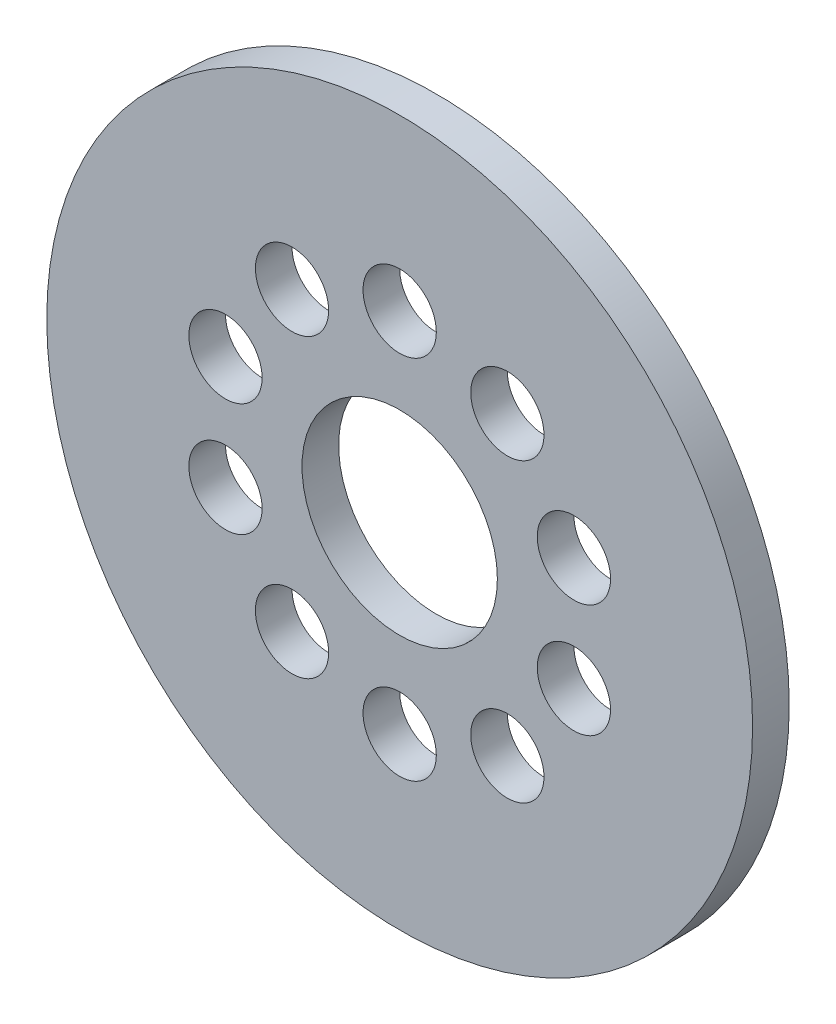
ISO-10303-21;
HEADER;
FILE_DESCRIPTION(('STEP AP214'),'2;1');
FILE_NAME('part.step','',(''),(''),'','','');
FILE_SCHEMA(('AUTOMOTIVE_DESIGN { 1 0 10303 214 1 1 1 1 }'));
ENDSEC;
DATA;
#1=APPLICATION_CONTEXT('core data for automotive mechanical design processes');
#2=APPLICATION_PROTOCOL_DEFINITION('international standard','automotive_design',2000,#1);
#3=PRODUCT_CONTEXT('',#1,'mechanical');
#4=PRODUCT('Part','Part','',(#3));
#5=PRODUCT_RELATED_PRODUCT_CATEGORY('part','',(#4));
#6=PRODUCT_DEFINITION_FORMATION('','',#4);
#7=PRODUCT_DEFINITION_CONTEXT('part definition',#1,'design');
#8=PRODUCT_DEFINITION('design','',#6,#7);
#9=PRODUCT_DEFINITION_SHAPE('','',#8);
#10=(LENGTH_UNIT() NAMED_UNIT(*) SI_UNIT(.MILLI.,.METRE.));
#11=(NAMED_UNIT(*) PLANE_ANGLE_UNIT() SI_UNIT($,.RADIAN.));
#12=(NAMED_UNIT(*) SI_UNIT($,.STERADIAN.) SOLID_ANGLE_UNIT());
#13=UNCERTAINTY_MEASURE_WITH_UNIT(LENGTH_MEASURE(1.E-05),#10,'distance_accuracy_value','');
#14=(GEOMETRIC_REPRESENTATION_CONTEXT(3) GLOBAL_UNCERTAINTY_ASSIGNED_CONTEXT((#13)) GLOBAL_UNIT_ASSIGNED_CONTEXT((#10,
#11,#12)) REPRESENTATION_CONTEXT('',''));
#15=CARTESIAN_POINT('',(0.,0.,0.));
#16=DIRECTION('',(0.,0.,1.));
#17=DIRECTION('',(1.,0.,0.));
#18=AXIS2_PLACEMENT_3D('',#15,#16,#17);
#19=CARTESIAN_POINT('',(0.,0.,7.5));
#20=DIRECTION('',(0.,0.,-1.));
#21=DIRECTION('',(-1.,0.,0.));
#22=AXIS2_PLACEMENT_3D('',#19,#20,#21);
#23=CYLINDRICAL_SURFACE('',#22,144.505);
#24=CARTESIAN_POINT('',(0.,0.,7.5));
#25=DIRECTION('',(0.,0.,1.));
#26=DIRECTION('',(1.,0.,0.));
#27=AXIS2_PLACEMENT_3D('',#24,#25,#26);
#28=CIRCLE('',#27,144.505);
#29=CARTESIAN_POINT('',(144.505,0.,7.5));
#30=VERTEX_POINT('',#29);
#31=EDGE_CURVE('E10',#30,#30,#28,.T.);
#32=ORIENTED_EDGE('',*,*,#31,.F.);
#33=EDGE_LOOP('',(#32));
#34=FACE_BOUND('',#33,.T.);
#35=CARTESIAN_POINT('',(0.,0.,-7.5));
#36=DIRECTION('',(0.,0.,1.));
#37=DIRECTION('',(1.,0.,0.));
#38=AXIS2_PLACEMENT_3D('',#35,#36,#37);
#39=CIRCLE('',#38,144.505);
#40=CARTESIAN_POINT('',(144.505,0.,-7.5));
#41=VERTEX_POINT('',#40);
#42=EDGE_CURVE('E40',#41,#41,#39,.T.);
#43=ORIENTED_EDGE('',*,*,#42,.T.);
#44=EDGE_LOOP('',(#43));
#45=FACE_BOUND('',#44,.T.);
#46=ADVANCED_FACE('F37',(#34,#45),#23,.T.);
#47=CARTESIAN_POINT('',(0.,0.,7.5));
#48=DIRECTION('',(0.,0.,1.));
#49=DIRECTION('',(1.,0.,0.));
#50=AXIS2_PLACEMENT_3D('',#47,#48,#49);
#51=PLANE('',#50);
#52=CARTESIAN_POINT('',(-71.3292387221365,-23.1762745781211,7.5));
#53=DIRECTION('',(0.,0.,1.));
#54=DIRECTION('',(1.,0.,0.));
#55=AXIS2_PLACEMENT_3D('',#52,#53,#54);
#56=CIRCLE('',#55,15.);
#57=CARTESIAN_POINT('',(-56.3292387221365,-23.1762745781211,7.5));
#58=VERTEX_POINT('',#57);
#59=EDGE_CURVE('E91',#58,#58,#56,.T.);
#60=ORIENTED_EDGE('',*,*,#59,.F.);
#61=EDGE_LOOP('',(#60));
#62=FACE_BOUND('',#61,.T.);
#63=CARTESIAN_POINT('',(-44.0838939219355,-60.6762745781211,7.5));
#64=DIRECTION('',(0.,0.,1.));
#65=DIRECTION('',(1.,0.,0.));
#66=AXIS2_PLACEMENT_3D('',#63,#64,#65);
#67=CIRCLE('',#66,15.);
#68=CARTESIAN_POINT('',(-29.0838939219355,-60.6762745781211,7.5));
#69=VERTEX_POINT('',#68);
#70=EDGE_CURVE('E100',#69,#69,#67,.T.);
#71=ORIENTED_EDGE('',*,*,#70,.F.);
#72=EDGE_LOOP('',(#71));
#73=FACE_BOUND('',#72,.T.);
#74=CARTESIAN_POINT('',(0.,-75.,7.5));
#75=DIRECTION('',(0.,0.,1.));
#76=DIRECTION('',(1.,0.,0.));
#77=AXIS2_PLACEMENT_3D('',#74,#75,#76);
#78=CIRCLE('',#77,15.);
#79=CARTESIAN_POINT('',(15.,-75.,7.5));
#80=VERTEX_POINT('',#79);
#81=EDGE_CURVE('E108',#80,#80,#78,.T.);
#82=ORIENTED_EDGE('',*,*,#81,.F.);
#83=EDGE_LOOP('',(#82));
#84=FACE_BOUND('',#83,.T.);
#85=CARTESIAN_POINT('',(44.0838939219355,-60.6762745781211,7.5));
#86=DIRECTION('',(0.,0.,1.));
#87=DIRECTION('',(1.,0.,0.));
#88=AXIS2_PLACEMENT_3D('',#85,#86,#87);
#89=CIRCLE('',#88,15.);
#90=CARTESIAN_POINT('',(59.0838939219355,-60.6762745781211,7.5));
#91=VERTEX_POINT('',#90);
#92=EDGE_CURVE('E116',#91,#91,#89,.T.);
#93=ORIENTED_EDGE('',*,*,#92,.F.);
#94=EDGE_LOOP('',(#93));
#95=FACE_BOUND('',#94,.T.);
#96=CARTESIAN_POINT('',(71.3292387221365,-23.176274578121,7.5));
#97=DIRECTION('',(0.,0.,1.));
#98=DIRECTION('',(1.,0.,0.));
#99=AXIS2_PLACEMENT_3D('',#96,#97,#98);
#100=CIRCLE('',#99,15.);
#101=CARTESIAN_POINT('',(86.3292387221366,-23.176274578121,7.5));
#102=VERTEX_POINT('',#101);
#103=EDGE_CURVE('E59',#102,#102,#100,.T.);
#104=ORIENTED_EDGE('',*,*,#103,.F.);
#105=EDGE_LOOP('',(#104));
#106=FACE_BOUND('',#105,.T.);
#107=CARTESIAN_POINT('',(71.3292387221365,23.1762745781211,7.5));
#108=DIRECTION('',(0.,0.,1.));
#109=DIRECTION('',(1.,0.,0.));
#110=AXIS2_PLACEMENT_3D('',#107,#108,#109);
#111=CIRCLE('',#110,15.);
#112=CARTESIAN_POINT('',(86.3292387221366,23.1762745781211,7.5));
#113=VERTEX_POINT('',#112);
#114=EDGE_CURVE('E68',#113,#113,#111,.T.);
#115=ORIENTED_EDGE('',*,*,#114,.F.);
#116=EDGE_LOOP('',(#115));
#117=FACE_BOUND('',#116,.T.);
#118=CARTESIAN_POINT('',(44.0838939219355,60.6762745781211,7.5));
#119=DIRECTION('',(0.,0.,1.));
#120=DIRECTION('',(1.,0.,0.));
#121=AXIS2_PLACEMENT_3D('',#118,#119,#120);
#122=CIRCLE('',#121,15.);
#123=CARTESIAN_POINT('',(59.0838939219355,60.6762745781211,7.5));
#124=VERTEX_POINT('',#123);
#125=EDGE_CURVE('E76',#124,#124,#122,.T.);
#126=ORIENTED_EDGE('',*,*,#125,.F.);
#127=EDGE_LOOP('',(#126));
#128=FACE_BOUND('',#127,.T.);
#129=CARTESIAN_POINT('',(0.,75.,7.5));
#130=DIRECTION('',(0.,0.,1.));
#131=DIRECTION('',(1.,0.,0.));
#132=AXIS2_PLACEMENT_3D('',#129,#130,#131);
#133=CIRCLE('',#132,15.);
#134=CARTESIAN_POINT('',(15.,75.,7.5));
#135=VERTEX_POINT('',#134);
#136=EDGE_CURVE('E84',#135,#135,#133,.T.);
#137=ORIENTED_EDGE('',*,*,#136,.F.);
#138=EDGE_LOOP('',(#137));
#139=FACE_BOUND('',#138,.T.);
#140=CARTESIAN_POINT('',(-71.3292387221365,23.176274578121,7.5));
#141=DIRECTION('',(0.,0.,1.));
#142=DIRECTION('',(1.,0.,0.));
#143=AXIS2_PLACEMENT_3D('',#140,#141,#142);
#144=CIRCLE('',#143,15.);
#145=CARTESIAN_POINT('',(-56.3292387221365,23.176274578121,7.5));
#146=VERTEX_POINT('',#145);
#147=EDGE_CURVE('E131',#146,#146,#144,.T.);
#148=ORIENTED_EDGE('',*,*,#147,.F.);
#149=EDGE_LOOP('',(#148));
#150=FACE_BOUND('',#149,.T.);
#151=CARTESIAN_POINT('',(-44.0838939219355,60.676274578121,7.5));
#152=DIRECTION('',(0.,0.,1.));
#153=DIRECTION('',(1.,0.,0.));
#154=AXIS2_PLACEMENT_3D('',#151,#152,#153);
#155=CIRCLE('',#154,15.);
#156=CARTESIAN_POINT('',(-29.0838939219355,60.676274578121,7.5));
#157=VERTEX_POINT('',#156);
#158=EDGE_CURVE('E123',#157,#157,#155,.T.);
#159=ORIENTED_EDGE('',*,*,#158,.F.);
#160=EDGE_LOOP('',(#159));
#161=FACE_BOUND('',#160,.T.);
#162=CARTESIAN_POINT('',(0.,0.,7.5));
#163=DIRECTION('',(0.,0.,1.));
#164=DIRECTION('',(1.,0.,0.));
#165=AXIS2_PLACEMENT_3D('',#162,#163,#164);
#166=CIRCLE('',#165,40.);
#167=CARTESIAN_POINT('',(40.,0.,7.5));
#168=VERTEX_POINT('',#167);
#169=EDGE_CURVE('E51',#168,#168,#166,.T.);
#170=ORIENTED_EDGE('',*,*,#169,.F.);
#171=EDGE_LOOP('',(#170));
#172=FACE_BOUND('',#171,.T.);
#173=ORIENTED_EDGE('',*,*,#31,.T.);
#174=EDGE_LOOP('',(#173));
#175=FACE_BOUND('',#174,.T.);
#176=ADVANCED_FACE('F150',(#62,#73,#84,#95,#106,#117,#128,#139,#150,#161,#172,#175),#51,.T.);
#177=CARTESIAN_POINT('',(0.,0.,-7.5));
#178=DIRECTION('',(0.,0.,1.));
#179=DIRECTION('',(1.,0.,0.));
#180=AXIS2_PLACEMENT_3D('',#177,#178,#179);
#181=PLANE('',#180);
#182=CARTESIAN_POINT('',(-71.3292387221365,-23.1762745781211,-7.5));
#183=DIRECTION('',(0.,0.,1.));
#184=DIRECTION('',(1.,0.,0.));
#185=AXIS2_PLACEMENT_3D('',#182,#183,#184);
#186=CIRCLE('',#185,15.);
#187=CARTESIAN_POINT('',(-56.3292387221365,-23.1762745781211,-7.5));
#188=VERTEX_POINT('',#187);
#189=EDGE_CURVE('E95',#188,#188,#186,.T.);
#190=ORIENTED_EDGE('',*,*,#189,.T.);
#191=EDGE_LOOP('',(#190));
#192=FACE_BOUND('',#191,.T.);
#193=CARTESIAN_POINT('',(-44.0838939219355,-60.6762745781211,-7.5));
#194=DIRECTION('',(0.,0.,1.));
#195=DIRECTION('',(1.,0.,0.));
#196=AXIS2_PLACEMENT_3D('',#193,#194,#195);
#197=CIRCLE('',#196,15.);
#198=CARTESIAN_POINT('',(-29.0838939219355,-60.6762745781211,-7.5));
#199=VERTEX_POINT('',#198);
#200=EDGE_CURVE('E104',#199,#199,#197,.T.);
#201=ORIENTED_EDGE('',*,*,#200,.T.);
#202=EDGE_LOOP('',(#201));
#203=FACE_BOUND('',#202,.T.);
#204=CARTESIAN_POINT('',(0.,-75.,-7.5));
#205=DIRECTION('',(0.,0.,1.));
#206=DIRECTION('',(1.,0.,0.));
#207=AXIS2_PLACEMENT_3D('',#204,#205,#206);
#208=CIRCLE('',#207,15.);
#209=CARTESIAN_POINT('',(15.,-75.,-7.5));
#210=VERTEX_POINT('',#209);
#211=EDGE_CURVE('E112',#210,#210,#208,.T.);
#212=ORIENTED_EDGE('',*,*,#211,.T.);
#213=EDGE_LOOP('',(#212));
#214=FACE_BOUND('',#213,.T.);
#215=CARTESIAN_POINT('',(44.0838939219355,-60.6762745781211,-7.5));
#216=DIRECTION('',(0.,0.,1.));
#217=DIRECTION('',(1.,0.,0.));
#218=AXIS2_PLACEMENT_3D('',#215,#216,#217);
#219=CIRCLE('',#218,15.);
#220=CARTESIAN_POINT('',(59.0838939219355,-60.6762745781211,-7.5));
#221=VERTEX_POINT('',#220);
#222=EDGE_CURVE('E64',#221,#221,#219,.T.);
#223=ORIENTED_EDGE('',*,*,#222,.T.);
#224=EDGE_LOOP('',(#223));
#225=FACE_BOUND('',#224,.T.);
#226=CARTESIAN_POINT('',(71.3292387221365,-23.176274578121,-7.5));
#227=DIRECTION('',(0.,0.,1.));
#228=DIRECTION('',(1.,0.,0.));
#229=AXIS2_PLACEMENT_3D('',#226,#227,#228);
#230=CIRCLE('',#229,15.);
#231=CARTESIAN_POINT('',(86.3292387221366,-23.176274578121,-7.5));
#232=VERTEX_POINT('',#231);
#233=EDGE_CURVE('E63',#232,#232,#230,.T.);
#234=ORIENTED_EDGE('',*,*,#233,.T.);
#235=EDGE_LOOP('',(#234));
#236=FACE_BOUND('',#235,.T.);
#237=CARTESIAN_POINT('',(71.3292387221365,23.1762745781211,-7.5));
#238=DIRECTION('',(0.,0.,1.));
#239=DIRECTION('',(1.,0.,0.));
#240=AXIS2_PLACEMENT_3D('',#237,#238,#239);
#241=CIRCLE('',#240,15.);
#242=CARTESIAN_POINT('',(86.3292387221366,23.1762745781211,-7.5));
#243=VERTEX_POINT('',#242);
#244=EDGE_CURVE('E72',#243,#243,#241,.T.);
#245=ORIENTED_EDGE('',*,*,#244,.T.);
#246=EDGE_LOOP('',(#245));
#247=FACE_BOUND('',#246,.T.);
#248=CARTESIAN_POINT('',(44.0838939219355,60.6762745781211,-7.5));
#249=DIRECTION('',(0.,0.,1.));
#250=DIRECTION('',(1.,0.,0.));
#251=AXIS2_PLACEMENT_3D('',#248,#249,#250);
#252=CIRCLE('',#251,15.);
#253=CARTESIAN_POINT('',(59.0838939219355,60.6762745781211,-7.5));
#254=VERTEX_POINT('',#253);
#255=EDGE_CURVE('E80',#254,#254,#252,.T.);
#256=ORIENTED_EDGE('',*,*,#255,.T.);
#257=EDGE_LOOP('',(#256));
#258=FACE_BOUND('',#257,.T.);
#259=CARTESIAN_POINT('',(0.,75.,-7.5));
#260=DIRECTION('',(0.,0.,1.));
#261=DIRECTION('',(1.,0.,0.));
#262=AXIS2_PLACEMENT_3D('',#259,#260,#261);
#263=CIRCLE('',#262,15.);
#264=CARTESIAN_POINT('',(15.,75.,-7.5));
#265=VERTEX_POINT('',#264);
#266=EDGE_CURVE('E55',#265,#265,#263,.T.);
#267=ORIENTED_EDGE('',*,*,#266,.T.);
#268=EDGE_LOOP('',(#267));
#269=FACE_BOUND('',#268,.T.);
#270=CARTESIAN_POINT('',(-71.3292387221365,23.176274578121,-7.5));
#271=DIRECTION('',(0.,0.,1.));
#272=DIRECTION('',(1.,0.,0.));
#273=AXIS2_PLACEMENT_3D('',#270,#271,#272);
#274=CIRCLE('',#273,15.);
#275=CARTESIAN_POINT('',(-56.3292387221365,23.176274578121,-7.5));
#276=VERTEX_POINT('',#275);
#277=EDGE_CURVE('E96',#276,#276,#274,.T.);
#278=ORIENTED_EDGE('',*,*,#277,.T.);
#279=EDGE_LOOP('',(#278));
#280=FACE_BOUND('',#279,.T.);
#281=CARTESIAN_POINT('',(-44.0838939219355,60.676274578121,-7.5));
#282=DIRECTION('',(0.,0.,1.));
#283=DIRECTION('',(1.,0.,0.));
#284=AXIS2_PLACEMENT_3D('',#281,#282,#283);
#285=CIRCLE('',#284,15.);
#286=CARTESIAN_POINT('',(-29.0838939219355,60.676274578121,-7.5));
#287=VERTEX_POINT('',#286);
#288=EDGE_CURVE('E127',#287,#287,#285,.T.);
#289=ORIENTED_EDGE('',*,*,#288,.T.);
#290=EDGE_LOOP('',(#289));
#291=FACE_BOUND('',#290,.T.);
#292=CARTESIAN_POINT('',(0.,0.,-7.5));
#293=DIRECTION('',(0.,0.,1.));
#294=DIRECTION('',(1.,0.,0.));
#295=AXIS2_PLACEMENT_3D('',#292,#293,#294);
#296=CIRCLE('',#295,40.);
#297=CARTESIAN_POINT('',(40.,0.,-7.5));
#298=VERTEX_POINT('',#297);
#299=EDGE_CURVE('E49',#298,#298,#296,.T.);
#300=ORIENTED_EDGE('',*,*,#299,.T.);
#301=EDGE_LOOP('',(#300));
#302=FACE_BOUND('',#301,.T.);
#303=ORIENTED_EDGE('',*,*,#42,.F.);
#304=EDGE_LOOP('',(#303));
#305=FACE_BOUND('',#304,.T.);
#306=ADVANCED_FACE('F139',(#192,#203,#214,#225,#236,#247,#258,#269,#280,#291,#302,#305),#181,.F.);
#307=CARTESIAN_POINT('',(0.,0.,-7.5));
#308=DIRECTION('',(0.,0.,1.));
#309=DIRECTION('',(1.,0.,0.));
#310=AXIS2_PLACEMENT_3D('',#307,#308,#309);
#311=CYLINDRICAL_SURFACE('',#310,40.);
#312=ORIENTED_EDGE('',*,*,#299,.F.);
#313=EDGE_LOOP('',(#312));
#314=FACE_BOUND('',#313,.T.);
#315=ORIENTED_EDGE('',*,*,#169,.T.);
#316=EDGE_LOOP('',(#315));
#317=FACE_BOUND('',#316,.T.);
#318=ADVANCED_FACE('F159',(#314,#317),#311,.F.);
#319=CARTESIAN_POINT('',(-44.0838939219355,60.676274578121,-7.5));
#320=DIRECTION('',(0.,0.,1.));
#321=DIRECTION('',(1.,0.,0.));
#322=AXIS2_PLACEMENT_3D('',#319,#320,#321);
#323=CYLINDRICAL_SURFACE('',#322,15.);
#324=ORIENTED_EDGE('',*,*,#288,.F.);
#325=EDGE_LOOP('',(#324));
#326=FACE_BOUND('',#325,.T.);
#327=ORIENTED_EDGE('',*,*,#158,.T.);
#328=EDGE_LOOP('',(#327));
#329=FACE_BOUND('',#328,.T.);
#330=ADVANCED_FACE('F146',(#326,#329),#323,.F.);
#331=CARTESIAN_POINT('',(-71.3292387221365,23.176274578121,-7.5));
#332=DIRECTION('',(0.,0.,1.));
#333=DIRECTION('',(1.,0.,0.));
#334=AXIS2_PLACEMENT_3D('',#331,#332,#333);
#335=CYLINDRICAL_SURFACE('',#334,15.);
#336=ORIENTED_EDGE('',*,*,#277,.F.);
#337=EDGE_LOOP('',(#336));
#338=FACE_BOUND('',#337,.T.);
#339=ORIENTED_EDGE('',*,*,#147,.T.);
#340=EDGE_LOOP('',(#339));
#341=FACE_BOUND('',#340,.T.);
#342=ADVANCED_FACE('F142',(#338,#341),#335,.F.);
#343=CARTESIAN_POINT('',(0.,75.,-7.5));
#344=DIRECTION('',(0.,0.,1.));
#345=DIRECTION('',(1.,0.,0.));
#346=AXIS2_PLACEMENT_3D('',#343,#344,#345);
#347=CYLINDRICAL_SURFACE('',#346,15.);
#348=ORIENTED_EDGE('',*,*,#266,.F.);
#349=EDGE_LOOP('',(#348));
#350=FACE_BOUND('',#349,.T.);
#351=ORIENTED_EDGE('',*,*,#136,.T.);
#352=EDGE_LOOP('',(#351));
#353=FACE_BOUND('',#352,.T.);
#354=ADVANCED_FACE('F145',(#350,#353),#347,.F.);
#355=CARTESIAN_POINT('',(44.0838939219355,60.6762745781211,-7.5));
#356=DIRECTION('',(0.,0.,1.));
#357=DIRECTION('',(1.,0.,0.));
#358=AXIS2_PLACEMENT_3D('',#355,#356,#357);
#359=CYLINDRICAL_SURFACE('',#358,15.);
#360=ORIENTED_EDGE('',*,*,#255,.F.);
#361=EDGE_LOOP('',(#360));
#362=FACE_BOUND('',#361,.T.);
#363=ORIENTED_EDGE('',*,*,#125,.T.);
#364=EDGE_LOOP('',(#363));
#365=FACE_BOUND('',#364,.T.);
#366=ADVANCED_FACE('F212',(#362,#365),#359,.F.);
#367=CARTESIAN_POINT('',(71.3292387221365,23.1762745781211,-7.5));
#368=DIRECTION('',(0.,0.,1.));
#369=DIRECTION('',(1.,0.,0.));
#370=AXIS2_PLACEMENT_3D('',#367,#368,#369);
#371=CYLINDRICAL_SURFACE('',#370,15.);
#372=ORIENTED_EDGE('',*,*,#244,.F.);
#373=EDGE_LOOP('',(#372));
#374=FACE_BOUND('',#373,.T.);
#375=ORIENTED_EDGE('',*,*,#114,.T.);
#376=EDGE_LOOP('',(#375));
#377=FACE_BOUND('',#376,.T.);
#378=ADVANCED_FACE('F222',(#374,#377),#371,.F.);
#379=CARTESIAN_POINT('',(71.3292387221365,-23.176274578121,-7.5));
#380=DIRECTION('',(0.,0.,1.));
#381=DIRECTION('',(1.,0.,0.));
#382=AXIS2_PLACEMENT_3D('',#379,#380,#381);
#383=CYLINDRICAL_SURFACE('',#382,15.);
#384=ORIENTED_EDGE('',*,*,#233,.F.);
#385=EDGE_LOOP('',(#384));
#386=FACE_BOUND('',#385,.T.);
#387=ORIENTED_EDGE('',*,*,#103,.T.);
#388=EDGE_LOOP('',(#387));
#389=FACE_BOUND('',#388,.T.);
#390=ADVANCED_FACE('F232',(#386,#389),#383,.F.);
#391=CARTESIAN_POINT('',(44.0838939219355,-60.6762745781211,-7.5));
#392=DIRECTION('',(0.,0.,1.));
#393=DIRECTION('',(1.,0.,0.));
#394=AXIS2_PLACEMENT_3D('',#391,#392,#393);
#395=CYLINDRICAL_SURFACE('',#394,15.);
#396=ORIENTED_EDGE('',*,*,#222,.F.);
#397=EDGE_LOOP('',(#396));
#398=FACE_BOUND('',#397,.T.);
#399=ORIENTED_EDGE('',*,*,#92,.T.);
#400=EDGE_LOOP('',(#399));
#401=FACE_BOUND('',#400,.T.);
#402=ADVANCED_FACE('F242',(#398,#401),#395,.F.);
#403=CARTESIAN_POINT('',(0.,-75.,-7.5));
#404=DIRECTION('',(0.,0.,1.));
#405=DIRECTION('',(1.,0.,0.));
#406=AXIS2_PLACEMENT_3D('',#403,#404,#405);
#407=CYLINDRICAL_SURFACE('',#406,15.);
#408=ORIENTED_EDGE('',*,*,#211,.F.);
#409=EDGE_LOOP('',(#408));
#410=FACE_BOUND('',#409,.T.);
#411=ORIENTED_EDGE('',*,*,#81,.T.);
#412=EDGE_LOOP('',(#411));
#413=FACE_BOUND('',#412,.T.);
#414=ADVANCED_FACE('F251',(#410,#413),#407,.F.);
#415=CARTESIAN_POINT('',(-44.0838939219355,-60.6762745781211,-7.5));
#416=DIRECTION('',(0.,0.,1.));
#417=DIRECTION('',(1.,0.,0.));
#418=AXIS2_PLACEMENT_3D('',#415,#416,#417);
#419=CYLINDRICAL_SURFACE('',#418,15.);
#420=ORIENTED_EDGE('',*,*,#200,.F.);
#421=EDGE_LOOP('',(#420));
#422=FACE_BOUND('',#421,.T.);
#423=ORIENTED_EDGE('',*,*,#70,.T.);
#424=EDGE_LOOP('',(#423));
#425=FACE_BOUND('',#424,.T.);
#426=ADVANCED_FACE('F261',(#422,#425),#419,.F.);
#427=CARTESIAN_POINT('',(-71.3292387221365,-23.1762745781211,-7.5));
#428=DIRECTION('',(0.,0.,1.));
#429=DIRECTION('',(1.,0.,0.));
#430=AXIS2_PLACEMENT_3D('',#427,#428,#429);
#431=CYLINDRICAL_SURFACE('',#430,15.);
#432=ORIENTED_EDGE('',*,*,#189,.F.);
#433=EDGE_LOOP('',(#432));
#434=FACE_BOUND('',#433,.T.);
#435=ORIENTED_EDGE('',*,*,#59,.T.);
#436=EDGE_LOOP('',(#435));
#437=FACE_BOUND('',#436,.T.);
#438=ADVANCED_FACE('F271',(#434,#437),#431,.F.);
#439=CLOSED_SHELL('',(#46,#176,#306,#318,#330,#342,#354,#366,#378,#390,#402,#414,#426,#438));
#440=MANIFOLD_SOLID_BREP('B2',#439);
#441=ADVANCED_BREP_SHAPE_REPRESENTATION('',(#18,#440),#14);
#442=SHAPE_DEFINITION_REPRESENTATION(#9,#441);
ENDSEC;
END-ISO-10303-21;
